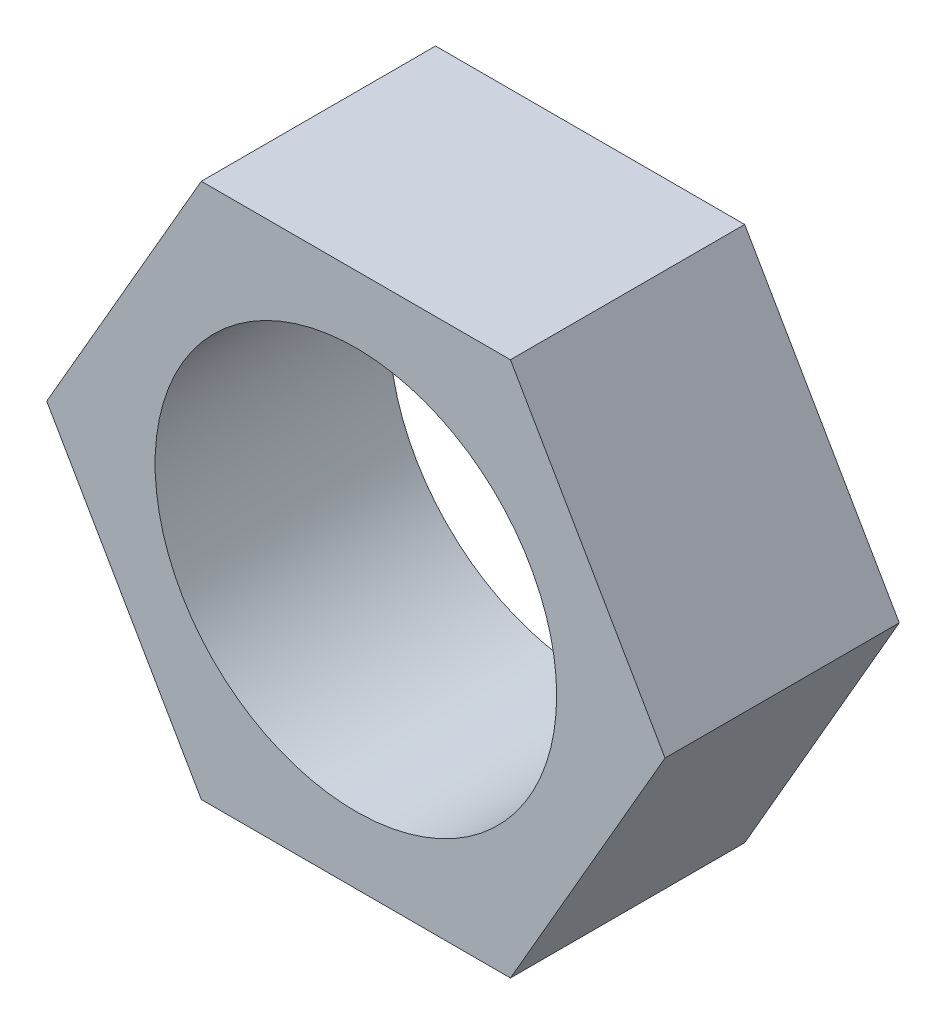
ISO-10303-21;
HEADER;
FILE_DESCRIPTION(('STEP AP214'),'2;1');
FILE_NAME('part.step','',(''),(''),'','','');
FILE_SCHEMA(('AUTOMOTIVE_DESIGN { 1 0 10303 214 1 1 1 1 }'));
ENDSEC;
DATA;
#1=APPLICATION_CONTEXT('core data for automotive mechanical design processes');
#2=APPLICATION_PROTOCOL_DEFINITION('international standard','automotive_design',2000,#1);
#3=PRODUCT_CONTEXT('',#1,'mechanical');
#4=PRODUCT('Part','Part','',(#3));
#5=PRODUCT_RELATED_PRODUCT_CATEGORY('part','',(#4));
#6=PRODUCT_DEFINITION_FORMATION('','',#4);
#7=PRODUCT_DEFINITION_CONTEXT('part definition',#1,'design');
#8=PRODUCT_DEFINITION('design','',#6,#7);
#9=PRODUCT_DEFINITION_SHAPE('','',#8);
#10=(LENGTH_UNIT() NAMED_UNIT(*) SI_UNIT(.MILLI.,.METRE.));
#11=(NAMED_UNIT(*) PLANE_ANGLE_UNIT() SI_UNIT($,.RADIAN.));
#12=(NAMED_UNIT(*) SI_UNIT($,.STERADIAN.) SOLID_ANGLE_UNIT());
#13=UNCERTAINTY_MEASURE_WITH_UNIT(LENGTH_MEASURE(1.E-05),#10,'distance_accuracy_value','');
#14=(GEOMETRIC_REPRESENTATION_CONTEXT(3) GLOBAL_UNCERTAINTY_ASSIGNED_CONTEXT((#13)) GLOBAL_UNIT_ASSIGNED_CONTEXT((#10,
#11,#12)) REPRESENTATION_CONTEXT('',''));
#15=CARTESIAN_POINT('',(0.,0.,0.));
#16=DIRECTION('',(0.,0.,1.));
#17=DIRECTION('',(1.,0.,0.));
#18=AXIS2_PLACEMENT_3D('',#15,#16,#17);
#19=CARTESIAN_POINT('',(0.,0.,7.));
#20=DIRECTION('',(0.,0.,1.));
#21=DIRECTION('',(1.,0.,0.));
#22=AXIS2_PLACEMENT_3D('',#19,#20,#21);
#23=PLANE('',#22);
#24=DIRECTION('',(0.5,0.866025403784439,0.));
#25=VECTOR('',#24,1.);
#26=CARTESIAN_POINT('',(4.61880215351701,-8.,7.));
#27=LINE('',#26,#25);
#28=CARTESIAN_POINT('',(4.61880215351701,-8.,7.));
#29=VERTEX_POINT('',#28);
#30=CARTESIAN_POINT('',(9.23760430703401,0.,7.));
#31=VERTEX_POINT('',#30);
#32=EDGE_CURVE('E129',#29,#31,#27,.T.);
#33=ORIENTED_EDGE('',*,*,#32,.T.);
#34=DIRECTION('',(-0.5,0.866025403784438,0.));
#35=VECTOR('',#34,1.);
#36=CARTESIAN_POINT('',(9.23760430703401,0.,7.));
#37=LINE('',#36,#35);
#38=CARTESIAN_POINT('',(4.618802153517,8.,7.));
#39=VERTEX_POINT('',#38);
#40=EDGE_CURVE('E87',#31,#39,#37,.T.);
#41=ORIENTED_EDGE('',*,*,#40,.T.);
#42=DIRECTION('',(-1.,0.,0.));
#43=VECTOR('',#42,1.);
#44=CARTESIAN_POINT('',(4.618802153517,8.,7.));
#45=LINE('',#44,#43);
#46=CARTESIAN_POINT('',(-4.61880215351701,8.,7.));
#47=VERTEX_POINT('',#46);
#48=EDGE_CURVE('E100',#39,#47,#45,.T.);
#49=ORIENTED_EDGE('',*,*,#48,.T.);
#50=DIRECTION('',(-0.5,-0.866025403784439,0.));
#51=VECTOR('',#50,1.);
#52=CARTESIAN_POINT('',(-4.61880215351701,8.,7.));
#53=LINE('',#52,#51);
#54=CARTESIAN_POINT('',(-9.23760430703402,0.,7.));
#55=VERTEX_POINT('',#54);
#56=EDGE_CURVE('E94',#47,#55,#53,.T.);
#57=ORIENTED_EDGE('',*,*,#56,.T.);
#58=DIRECTION('',(0.5,-0.866025403784439,0.));
#59=VECTOR('',#58,1.);
#60=CARTESIAN_POINT('',(-9.23760430703402,0.,7.));
#61=LINE('',#60,#59);
#62=CARTESIAN_POINT('',(-4.61880215351701,-8.,7.));
#63=VERTEX_POINT('',#62);
#64=EDGE_CURVE('E98',#55,#63,#61,.T.);
#65=ORIENTED_EDGE('',*,*,#64,.T.);
#66=DIRECTION('',(1.,0.,0.));
#67=VECTOR('',#66,1.);
#68=CARTESIAN_POINT('',(-4.61880215351701,-8.,7.));
#69=LINE('',#68,#67);
#70=EDGE_CURVE('E50',#63,#29,#69,.T.);
#71=ORIENTED_EDGE('',*,*,#70,.T.);
#72=EDGE_LOOP('',(#33,#41,#49,#57,#65,#71));
#73=FACE_BOUND('',#72,.T.);
#74=CARTESIAN_POINT('',(0.,0.,7.));
#75=DIRECTION('',(0.,0.,1.));
#76=DIRECTION('',(1.,0.,0.));
#77=AXIS2_PLACEMENT_3D('',#74,#75,#76);
#78=CIRCLE('',#77,6.);
#79=CARTESIAN_POINT('',(6.,0.,7.));
#80=VERTEX_POINT('',#79);
#81=EDGE_CURVE('E122',#80,#80,#78,.T.);
#82=ORIENTED_EDGE('',*,*,#81,.F.);
#83=EDGE_LOOP('',(#82));
#84=FACE_BOUND('',#83,.T.);
#85=ADVANCED_FACE('F33',(#73,#84),#23,.T.);
#86=CARTESIAN_POINT('',(0.,0.,0.));
#87=DIRECTION('',(0.,0.,1.));
#88=DIRECTION('',(1.,0.,0.));
#89=AXIS2_PLACEMENT_3D('',#86,#87,#88);
#90=PLANE('',#89);
#91=DIRECTION('',(0.5,0.866025403784439,0.));
#92=VECTOR('',#91,1.);
#93=CARTESIAN_POINT('',(4.61880215351701,-8.,0.));
#94=LINE('',#93,#92);
#95=CARTESIAN_POINT('',(4.61880215351701,-8.,0.));
#96=VERTEX_POINT('',#95);
#97=CARTESIAN_POINT('',(9.23760430703401,0.,0.));
#98=VERTEX_POINT('',#97);
#99=EDGE_CURVE('E118',#96,#98,#94,.T.);
#100=ORIENTED_EDGE('',*,*,#99,.F.);
#101=DIRECTION('',(1.,0.,0.));
#102=VECTOR('',#101,1.);
#103=CARTESIAN_POINT('',(-4.61880215351701,-8.,0.));
#104=LINE('',#103,#102);
#105=CARTESIAN_POINT('',(-4.61880215351701,-8.,0.));
#106=VERTEX_POINT('',#105);
#107=EDGE_CURVE('E79',#106,#96,#104,.T.);
#108=ORIENTED_EDGE('',*,*,#107,.F.);
#109=DIRECTION('',(0.5,-0.866025403784439,0.));
#110=VECTOR('',#109,1.);
#111=CARTESIAN_POINT('',(-9.23760430703402,0.,0.));
#112=LINE('',#111,#110);
#113=CARTESIAN_POINT('',(-9.23760430703402,0.,0.));
#114=VERTEX_POINT('',#113);
#115=EDGE_CURVE('E73',#114,#106,#112,.T.);
#116=ORIENTED_EDGE('',*,*,#115,.F.);
#117=DIRECTION('',(-0.5,-0.866025403784439,0.));
#118=VECTOR('',#117,1.);
#119=CARTESIAN_POINT('',(-4.61880215351701,8.,0.));
#120=LINE('',#119,#118);
#121=CARTESIAN_POINT('',(-4.61880215351701,8.,0.));
#122=VERTEX_POINT('',#121);
#123=EDGE_CURVE('E108',#122,#114,#120,.T.);
#124=ORIENTED_EDGE('',*,*,#123,.F.);
#125=DIRECTION('',(-1.,0.,0.));
#126=VECTOR('',#125,1.);
#127=CARTESIAN_POINT('',(4.618802153517,8.,0.));
#128=LINE('',#127,#126);
#129=CARTESIAN_POINT('',(4.618802153517,8.,0.));
#130=VERTEX_POINT('',#129);
#131=EDGE_CURVE('E124',#130,#122,#128,.T.);
#132=ORIENTED_EDGE('',*,*,#131,.F.);
#133=DIRECTION('',(-0.5,0.866025403784438,0.));
#134=VECTOR('',#133,1.);
#135=CARTESIAN_POINT('',(9.23760430703401,0.,0.));
#136=LINE('',#135,#134);
#137=EDGE_CURVE('E121',#98,#130,#136,.T.);
#138=ORIENTED_EDGE('',*,*,#137,.F.);
#139=EDGE_LOOP('',(#100,#108,#116,#124,#132,#138));
#140=FACE_BOUND('',#139,.T.);
#141=CARTESIAN_POINT('',(0.,0.,0.));
#142=DIRECTION('',(0.,0.,1.));
#143=DIRECTION('',(1.,0.,0.));
#144=AXIS2_PLACEMENT_3D('',#141,#142,#143);
#145=CIRCLE('',#144,6.);
#146=CARTESIAN_POINT('',(6.,0.,0.));
#147=VERTEX_POINT('',#146);
#148=EDGE_CURVE('E222',#147,#147,#145,.T.);
#149=ORIENTED_EDGE('',*,*,#148,.T.);
#150=EDGE_LOOP('',(#149));
#151=FACE_BOUND('',#150,.T.);
#152=ADVANCED_FACE('F138',(#140,#151),#90,.F.);
#153=CARTESIAN_POINT('',(4.61880215351701,-8.,7.));
#154=DIRECTION('',(-0.866025403784439,0.5,0.));
#155=DIRECTION('',(-0.5,-0.866025403784439,0.));
#156=AXIS2_PLACEMENT_3D('',#153,#154,#155);
#157=PLANE('',#156);
#158=ORIENTED_EDGE('',*,*,#99,.T.);
#159=DIRECTION('',(0.,0.,-1.));
#160=VECTOR('',#159,1.);
#161=CARTESIAN_POINT('',(9.23760430703401,0.,7.));
#162=LINE('',#161,#160);
#163=EDGE_CURVE('E11',#31,#98,#162,.T.);
#164=ORIENTED_EDGE('',*,*,#163,.F.);
#165=ORIENTED_EDGE('',*,*,#32,.F.);
#166=DIRECTION('',(0.,0.,-1.));
#167=VECTOR('',#166,1.);
#168=CARTESIAN_POINT('',(4.61880215351701,-8.,7.));
#169=LINE('',#168,#167);
#170=EDGE_CURVE('E114',#29,#96,#169,.T.);
#171=ORIENTED_EDGE('',*,*,#170,.T.);
#172=EDGE_LOOP('',(#158,#164,#165,#171));
#173=FACE_BOUND('',#172,.T.);
#174=ADVANCED_FACE('F35',(#173),#157,.F.);
#175=CARTESIAN_POINT('',(9.23760430703401,0.,7.));
#176=DIRECTION('',(-0.866025403784438,-0.5,0.));
#177=DIRECTION('',(0.5,-0.866025403784439,0.));
#178=AXIS2_PLACEMENT_3D('',#175,#176,#177);
#179=PLANE('',#178);
#180=ORIENTED_EDGE('',*,*,#137,.T.);
#181=DIRECTION('',(0.,0.,-1.));
#182=VECTOR('',#181,1.);
#183=CARTESIAN_POINT('',(4.618802153517,8.,7.));
#184=LINE('',#183,#182);
#185=EDGE_CURVE('E42',#39,#130,#184,.T.);
#186=ORIENTED_EDGE('',*,*,#185,.F.);
#187=ORIENTED_EDGE('',*,*,#40,.F.);
#188=ORIENTED_EDGE('',*,*,#163,.T.);
#189=EDGE_LOOP('',(#180,#186,#187,#188));
#190=FACE_BOUND('',#189,.T.);
#191=ADVANCED_FACE('F163',(#190),#179,.F.);
#192=CARTESIAN_POINT('',(4.618802153517,8.,7.));
#193=DIRECTION('',(0.,-1.,0.));
#194=DIRECTION('',(0.,0.,-1.));
#195=AXIS2_PLACEMENT_3D('',#192,#193,#194);
#196=PLANE('',#195);
#197=ORIENTED_EDGE('',*,*,#131,.T.);
#198=DIRECTION('',(0.,0.,-1.));
#199=VECTOR('',#198,1.);
#200=CARTESIAN_POINT('',(-4.61880215351701,8.,7.));
#201=LINE('',#200,#199);
#202=EDGE_CURVE('E109',#47,#122,#201,.T.);
#203=ORIENTED_EDGE('',*,*,#202,.F.);
#204=ORIENTED_EDGE('',*,*,#48,.F.);
#205=ORIENTED_EDGE('',*,*,#185,.T.);
#206=EDGE_LOOP('',(#197,#203,#204,#205));
#207=FACE_BOUND('',#206,.T.);
#208=ADVANCED_FACE('F135',(#207),#196,.F.);
#209=CARTESIAN_POINT('',(-4.61880215351701,8.,7.));
#210=DIRECTION('',(0.866025403784439,-0.5,0.));
#211=DIRECTION('',(0.5,0.866025403784439,0.));
#212=AXIS2_PLACEMENT_3D('',#209,#210,#211);
#213=PLANE('',#212);
#214=ORIENTED_EDGE('',*,*,#123,.T.);
#215=DIRECTION('',(0.,0.,-1.));
#216=VECTOR('',#215,1.);
#217=CARTESIAN_POINT('',(-9.23760430703402,0.,7.));
#218=LINE('',#217,#216);
#219=EDGE_CURVE('E105',#55,#114,#218,.T.);
#220=ORIENTED_EDGE('',*,*,#219,.F.);
#221=ORIENTED_EDGE('',*,*,#56,.F.);
#222=ORIENTED_EDGE('',*,*,#202,.T.);
#223=EDGE_LOOP('',(#214,#220,#221,#222));
#224=FACE_BOUND('',#223,.T.);
#225=ADVANCED_FACE('F106',(#224),#213,.F.);
#226=CARTESIAN_POINT('',(-9.23760430703402,0.,7.));
#227=DIRECTION('',(0.866025403784439,0.5,0.));
#228=DIRECTION('',(-0.5,0.866025403784439,0.));
#229=AXIS2_PLACEMENT_3D('',#226,#227,#228);
#230=PLANE('',#229);
#231=ORIENTED_EDGE('',*,*,#115,.T.);
#232=DIRECTION('',(0.,0.,-1.));
#233=VECTOR('',#232,1.);
#234=CARTESIAN_POINT('',(-4.61880215351701,-8.,7.));
#235=LINE('',#234,#233);
#236=EDGE_CURVE('E110',#63,#106,#235,.T.);
#237=ORIENTED_EDGE('',*,*,#236,.F.);
#238=ORIENTED_EDGE('',*,*,#64,.F.);
#239=ORIENTED_EDGE('',*,*,#219,.T.);
#240=EDGE_LOOP('',(#231,#237,#238,#239));
#241=FACE_BOUND('',#240,.T.);
#242=ADVANCED_FACE('F112',(#241),#230,.F.);
#243=CARTESIAN_POINT('',(-4.61880215351701,-8.,7.));
#244=DIRECTION('',(0.,1.,0.));
#245=DIRECTION('',(0.,0.,1.));
#246=AXIS2_PLACEMENT_3D('',#243,#244,#245);
#247=PLANE('',#246);
#248=ORIENTED_EDGE('',*,*,#107,.T.);
#249=ORIENTED_EDGE('',*,*,#170,.F.);
#250=ORIENTED_EDGE('',*,*,#70,.F.);
#251=ORIENTED_EDGE('',*,*,#236,.T.);
#252=EDGE_LOOP('',(#248,#249,#250,#251));
#253=FACE_BOUND('',#252,.T.);
#254=ADVANCED_FACE('F143',(#253),#247,.F.);
#255=CARTESIAN_POINT('',(0.,0.,7.));
#256=DIRECTION('',(0.,0.,-1.));
#257=DIRECTION('',(-1.,0.,0.));
#258=AXIS2_PLACEMENT_3D('',#255,#256,#257);
#259=CYLINDRICAL_SURFACE('',#258,6.);
#260=ORIENTED_EDGE('',*,*,#81,.T.);
#261=EDGE_LOOP('',(#260));
#262=FACE_BOUND('',#261,.T.);
#263=ORIENTED_EDGE('',*,*,#148,.F.);
#264=EDGE_LOOP('',(#263));
#265=FACE_BOUND('',#264,.T.);
#266=ADVANCED_FACE('F145',(#262,#265),#259,.F.);
#267=CLOSED_SHELL('',(#85,#152,#174,#191,#208,#225,#242,#254,#266));
#268=MANIFOLD_SOLID_BREP('B2',#267);
#269=ADVANCED_BREP_SHAPE_REPRESENTATION('',(#18,#268),#14);
#270=SHAPE_DEFINITION_REPRESENTATION(#9,#269);
ENDSEC;
END-ISO-10303-21;
